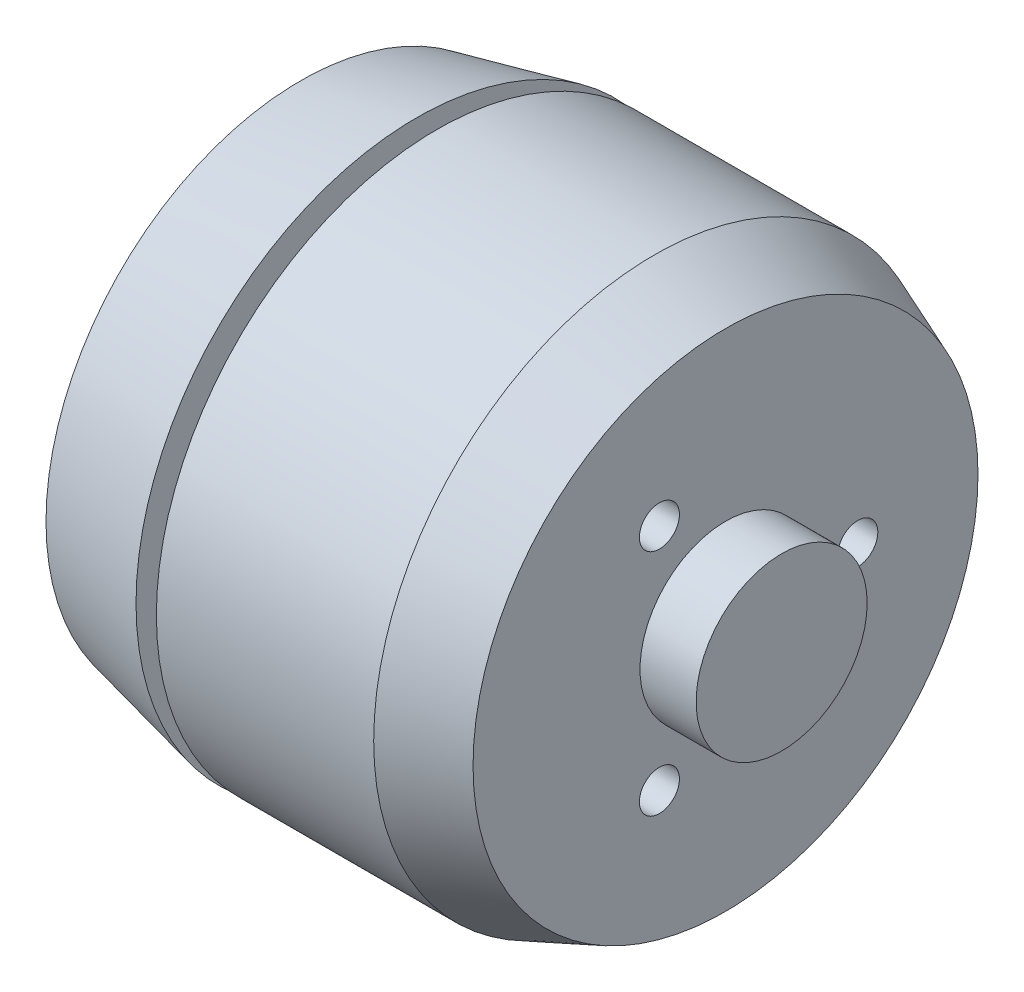
ISO-10303-21;
HEADER;
FILE_DESCRIPTION(('STEP AP214'),'2;1');
FILE_NAME('part.step','',(''),(''),'','','');
FILE_SCHEMA(('AUTOMOTIVE_DESIGN { 1 0 10303 214 1 1 1 1 }'));
ENDSEC;
DATA;
#1=APPLICATION_CONTEXT('core data for automotive mechanical design processes');
#2=APPLICATION_PROTOCOL_DEFINITION('international standard','automotive_design',2000,#1);
#3=PRODUCT_CONTEXT('',#1,'mechanical');
#4=PRODUCT('Part','Part','',(#3));
#5=PRODUCT_RELATED_PRODUCT_CATEGORY('part','',(#4));
#6=PRODUCT_DEFINITION_FORMATION('','',#4);
#7=PRODUCT_DEFINITION_CONTEXT('part definition',#1,'design');
#8=PRODUCT_DEFINITION('design','',#6,#7);
#9=PRODUCT_DEFINITION_SHAPE('','',#8);
#10=(LENGTH_UNIT() NAMED_UNIT(*) SI_UNIT(.MILLI.,.METRE.));
#11=(NAMED_UNIT(*) PLANE_ANGLE_UNIT() SI_UNIT($,.RADIAN.));
#12=(NAMED_UNIT(*) SI_UNIT($,.STERADIAN.) SOLID_ANGLE_UNIT());
#13=UNCERTAINTY_MEASURE_WITH_UNIT(LENGTH_MEASURE(1.E-05),#10,'distance_accuracy_value','');
#14=(GEOMETRIC_REPRESENTATION_CONTEXT(3) GLOBAL_UNCERTAINTY_ASSIGNED_CONTEXT((#13)) GLOBAL_UNIT_ASSIGNED_CONTEXT((#10,
#11,#12)) REPRESENTATION_CONTEXT('',''));
#15=CARTESIAN_POINT('',(0.,0.,0.));
#16=DIRECTION('',(0.,0.,1.));
#17=DIRECTION('',(1.,0.,0.));
#18=AXIS2_PLACEMENT_3D('',#15,#16,#17);
#19=CARTESIAN_POINT('',(6.,0.,0.));
#20=DIRECTION('',(0.,0.,-1.));
#21=DIRECTION('',(0.,-1.,0.));
#22=AXIS2_PLACEMENT_3D('',#19,#20,#21);
#23=PLANE('',#22);
#24=DIRECTION('',(0.,1.,0.));
#25=VECTOR('',#24,1.);
#26=CARTESIAN_POINT('',(12.9854,-5.08,0.));
#27=LINE('',#26,#25);
#28=CARTESIAN_POINT('',(12.9854,-5.08,0.));
#29=VERTEX_POINT('',#28);
#30=CARTESIAN_POINT('',(12.9854,5.08,0.));
#31=VERTEX_POINT('',#30);
#32=EDGE_CURVE('E130',#29,#31,#27,.T.);
#33=ORIENTED_EDGE('',*,*,#32,.F.);
#34=DIRECTION('',(1.,0.,0.));
#35=VECTOR('',#34,1.);
#36=CARTESIAN_POINT('',(8.2356,-5.08,0.));
#37=LINE('',#36,#35);
#38=CARTESIAN_POINT('',(8.2356,-5.08,0.));
#39=VERTEX_POINT('',#38);
#40=EDGE_CURVE('E135',#39,#29,#37,.T.);
#41=ORIENTED_EDGE('',*,*,#40,.F.);
#42=DIRECTION('',(0.,-1.,0.));
#43=VECTOR('',#42,1.);
#44=CARTESIAN_POINT('',(8.2356,-5.08,0.));
#45=LINE('',#44,#43);
#46=CARTESIAN_POINT('',(8.2356,5.08,0.));
#47=VERTEX_POINT('',#46);
#48=EDGE_CURVE('E10',#47,#39,#45,.T.);
#49=ORIENTED_EDGE('',*,*,#48,.F.);
#50=DIRECTION('',(-1.,0.,0.));
#51=VECTOR('',#50,1.);
#52=CARTESIAN_POINT('',(8.2356,5.08,0.));
#53=LINE('',#52,#51);
#54=EDGE_CURVE('E127',#31,#47,#53,.T.);
#55=ORIENTED_EDGE('',*,*,#54,.F.);
#56=EDGE_LOOP('',(#33,#41,#49,#55));
#57=FACE_BOUND('',#56,.T.);
#58=ADVANCED_FACE('F16',(#57),#23,.T.);
#59=CARTESIAN_POINT('',(8.2356,-5.08,-17.5));
#60=DIRECTION('',(-1.,0.,0.));
#61=DIRECTION('',(0.,0.,1.));
#62=AXIS2_PLACEMENT_3D('',#59,#60,#61);
#63=PLANE('',#62);
#64=CARTESIAN_POINT('',(8.2356,0.,-11.0612));
#65=DIRECTION('',(1.,0.,0.));
#66=DIRECTION('',(0.,0.,1.));
#67=AXIS2_PLACEMENT_3D('',#64,#65,#66);
#68=CIRCLE('',#67,4.);
#69=CARTESIAN_POINT('',(8.2356,0.,-15.0612));
#70=VERTEX_POINT('',#69);
#71=EDGE_CURVE('E257',#70,#70,#68,.T.);
#72=ORIENTED_EDGE('',*,*,#71,.F.);
#73=EDGE_LOOP('',(#72));
#74=FACE_BOUND('',#73,.T.);
#75=DIRECTION('',(0.,0.,1.));
#76=VECTOR('',#75,1.);
#77=CARTESIAN_POINT('',(8.2356,5.08,-17.5));
#78=LINE('',#77,#76);
#79=CARTESIAN_POINT('',(8.2356,5.08,-15.3348552618978));
#80=VERTEX_POINT('',#79);
#81=EDGE_CURVE('E27',#80,#47,#78,.T.);
#82=ORIENTED_EDGE('',*,*,#81,.T.);
#83=ORIENTED_EDGE('',*,*,#48,.T.);
#84=DIRECTION('',(0.,0.,1.));
#85=VECTOR('',#84,1.);
#86=CARTESIAN_POINT('',(8.2356,-5.08,-17.5));
#87=LINE('',#86,#85);
#88=CARTESIAN_POINT('',(8.2356,-5.08,-15.3348552618978));
#89=VERTEX_POINT('',#88);
#90=EDGE_CURVE('E147',#89,#39,#87,.T.);
#91=ORIENTED_EDGE('',*,*,#90,.F.);
#92=CARTESIAN_POINT('',(8.2356,0.,0.));
#93=DIRECTION('',(-1.,0.,0.));
#94=DIRECTION('',(0.,0.,1.));
#95=AXIS2_PLACEMENT_3D('',#92,#93,#94);
#96=CIRCLE('',#95,16.1543859649123);
#97=EDGE_CURVE('E333',#80,#89,#96,.T.);
#98=ORIENTED_EDGE('',*,*,#97,.F.);
#99=EDGE_LOOP('',(#82,#83,#91,#98));
#100=FACE_BOUND('',#99,.T.);
#101=ADVANCED_FACE('F438',(#74,#100),#63,.F.);
#102=CARTESIAN_POINT('',(8.2356,5.08,-17.5));
#103=DIRECTION('',(0.,1.,0.));
#104=DIRECTION('',(1.,0.,0.));
#105=AXIS2_PLACEMENT_3D('',#102,#103,#104);
#106=PLANE('',#105);
#107=DIRECTION('',(0.,0.,1.));
#108=VECTOR('',#107,1.);
#109=CARTESIAN_POINT('',(12.9854,5.08,-17.5));
#110=LINE('',#109,#108);
#111=CARTESIAN_POINT('',(12.9854,5.08,-16.4542744521131));
#112=VERTEX_POINT('',#111);
#113=EDGE_CURVE('E139',#112,#31,#110,.T.);
#114=ORIENTED_EDGE('',*,*,#113,.T.);
#115=ORIENTED_EDGE('',*,*,#54,.T.);
#116=ORIENTED_EDGE('',*,*,#81,.F.);
#117=CARTESIAN_POINT('',(12.9854,5.08,-16.4542744521131));
#118=CARTESIAN_POINT('',(11.4018708577131,5.08,-16.0822506345086));
#119=CARTESIAN_POINT('',(9.81858512751308,5.08,-15.7091919528578));
#120=CARTESIAN_POINT('',(8.2356,5.08,-15.3348552618978));
#121=(BOUNDED_CURVE() B_SPLINE_CURVE(3,(#117,#118,#119,#120),.UNSPECIFIED.,.F.,
.F.) B_SPLINE_CURVE_WITH_KNOTS((4,4),(0.0186183002080263,0.0234982279464003),
.UNSPECIFIED.) CURVE() GEOMETRIC_REPRESENTATION_ITEM() RATIONAL_B_SPLINE_CURVE((1.,1.,1.,1.)) REPRESENTATION_ITEM(''));
#122=EDGE_CURVE('E142',#112,#80,#121,.T.);
#123=ORIENTED_EDGE('',*,*,#122,.F.);
#124=EDGE_LOOP('',(#114,#115,#116,#123));
#125=FACE_BOUND('',#124,.T.);
#126=ADVANCED_FACE('F140',(#125),#106,.F.);
#127=CARTESIAN_POINT('',(8.2356,-5.08,-17.5));
#128=DIRECTION('',(0.,-1.,0.));
#129=DIRECTION('',(0.,0.,-1.));
#130=AXIS2_PLACEMENT_3D('',#127,#128,#129);
#131=PLANE('',#130);
#132=ORIENTED_EDGE('',*,*,#90,.T.);
#133=ORIENTED_EDGE('',*,*,#40,.T.);
#134=DIRECTION('',(0.,0.,1.));
#135=VECTOR('',#134,1.);
#136=CARTESIAN_POINT('',(12.9854,-5.08,-17.5));
#137=LINE('',#136,#135);
#138=CARTESIAN_POINT('',(12.9854,-5.08,-16.4542744521131));
#139=VERTEX_POINT('',#138);
#140=EDGE_CURVE('E151',#139,#29,#137,.T.);
#141=ORIENTED_EDGE('',*,*,#140,.F.);
#142=CARTESIAN_POINT('',(8.2356,-5.08,-15.3348552618978));
#143=CARTESIAN_POINT('',(9.81858357885326,-5.08,-15.7091915866381));
#144=CARTESIAN_POINT('',(11.4018724037992,-5.08,-16.0822509977358));
#145=CARTESIAN_POINT('',(12.9854,-5.08,-16.4542744521131));
#146=(BOUNDED_CURVE() B_SPLINE_CURVE(3,(#142,#143,#144,#145),.UNSPECIFIED.,.F.,
.F.) B_SPLINE_CURVE_WITH_KNOTS((4,4),(0.0186526350852368,0.0235325216490011),
.UNSPECIFIED.) CURVE() GEOMETRIC_REPRESENTATION_ITEM() RATIONAL_B_SPLINE_CURVE((1.,1.,1.,1.)) REPRESENTATION_ITEM(''));
#147=EDGE_CURVE('E183',#89,#139,#146,.T.);
#148=ORIENTED_EDGE('',*,*,#147,.F.);
#149=EDGE_LOOP('',(#132,#133,#141,#148));
#150=FACE_BOUND('',#149,.T.);
#151=ADVANCED_FACE('F480',(#150),#131,.F.);
#152=CARTESIAN_POINT('',(12.9854,-5.08,-17.5));
#153=DIRECTION('',(1.,0.,0.));
#154=DIRECTION('',(0.,0.,1.));
#155=AXIS2_PLACEMENT_3D('',#152,#153,#154);
#156=PLANE('',#155);
#157=ORIENTED_EDGE('',*,*,#140,.T.);
#158=ORIENTED_EDGE('',*,*,#32,.T.);
#159=ORIENTED_EDGE('',*,*,#113,.F.);
#160=CARTESIAN_POINT('',(12.9854,0.,0.));
#161=DIRECTION('',(1.,0.,0.));
#162=DIRECTION('',(0.,0.,-1.));
#163=AXIS2_PLACEMENT_3D('',#160,#161,#162);
#164=CIRCLE('',#163,17.2206140350877);
#165=EDGE_CURVE('E180',#139,#112,#164,.T.);
#166=ORIENTED_EDGE('',*,*,#165,.F.);
#167=EDGE_LOOP('',(#157,#158,#159,#166));
#168=FACE_BOUND('',#167,.T.);
#169=ADVANCED_FACE('F149',(#168),#156,.F.);
#170=CARTESIAN_POINT('',(11.436,-11.0612,0.));
#171=DIRECTION('',(-1.,0.,0.));
#172=DIRECTION('',(0.,0.,1.));
#173=AXIS2_PLACEMENT_3D('',#170,#171,#172);
#174=PLANE('',#173);
#175=CARTESIAN_POINT('',(11.436,-11.0612,0.));
#176=DIRECTION('',(-1.,0.,0.));
#177=DIRECTION('',(0.,0.,1.));
#178=AXIS2_PLACEMENT_3D('',#175,#176,#177);
#179=CIRCLE('',#178,4.);
#180=CARTESIAN_POINT('',(11.436,-11.0612,-4.));
#181=VERTEX_POINT('',#180);
#182=EDGE_CURVE('E334',#181,#181,#179,.T.);
#183=ORIENTED_EDGE('',*,*,#182,.T.);
#184=EDGE_LOOP('',(#183));
#185=FACE_BOUND('',#184,.T.);
#186=ADVANCED_FACE('F582',(#185),#174,.T.);
#187=CARTESIAN_POINT('',(11.436,-6.71751442127222,-6.71751442127219));
#188=DIRECTION('',(-1.,0.,0.));
#189=DIRECTION('',(0.,0.,1.));
#190=AXIS2_PLACEMENT_3D('',#187,#188,#189);
#191=PLANE('',#190);
#192=CARTESIAN_POINT('',(11.436,-6.71751442127222,-6.71751442127219));
#193=DIRECTION('',(-1.,0.,0.));
#194=DIRECTION('',(0.,0.,1.));
#195=AXIS2_PLACEMENT_3D('',#192,#193,#194);
#196=CIRCLE('',#195,1.5);
#197=CARTESIAN_POINT('',(11.436,-6.71751442127222,-8.21751442127219));
#198=VERTEX_POINT('',#197);
#199=EDGE_CURVE('E190',#198,#198,#196,.T.);
#200=ORIENTED_EDGE('',*,*,#199,.T.);
#201=EDGE_LOOP('',(#200));
#202=FACE_BOUND('',#201,.T.);
#203=ADVANCED_FACE('F584',(#202),#191,.T.);
#204=CARTESIAN_POINT('',(11.436,8.83883476483182,-8.83883476483186));
#205=DIRECTION('',(-1.,0.,0.));
#206=DIRECTION('',(0.,0.,1.));
#207=AXIS2_PLACEMENT_3D('',#204,#205,#206);
#208=PLANE('',#207);
#209=CARTESIAN_POINT('',(11.436,8.83883476483182,-8.83883476483186));
#210=DIRECTION('',(-1.,0.,0.));
#211=DIRECTION('',(0.,0.,1.));
#212=AXIS2_PLACEMENT_3D('',#209,#210,#211);
#213=CIRCLE('',#212,1.5);
#214=CARTESIAN_POINT('',(11.436,8.83883476483182,-10.3388347648319));
#215=VERTEX_POINT('',#214);
#216=EDGE_CURVE('E360',#215,#215,#213,.T.);
#217=ORIENTED_EDGE('',*,*,#216,.T.);
#218=EDGE_LOOP('',(#217));
#219=FACE_BOUND('',#218,.T.);
#220=ADVANCED_FACE('F590',(#219),#208,.T.);
#221=CARTESIAN_POINT('',(11.436,-8.83883476483183,8.83883476483186));
#222=DIRECTION('',(-1.,0.,0.));
#223=DIRECTION('',(0.,0.,1.));
#224=AXIS2_PLACEMENT_3D('',#221,#222,#223);
#225=PLANE('',#224);
#226=CARTESIAN_POINT('',(11.436,-8.83883476483183,8.83883476483186));
#227=DIRECTION('',(-1.,0.,0.));
#228=DIRECTION('',(0.,0.,1.));
#229=AXIS2_PLACEMENT_3D('',#226,#227,#228);
#230=CIRCLE('',#229,1.5);
#231=CARTESIAN_POINT('',(11.436,-8.83883476483183,7.33883476483186));
#232=VERTEX_POINT('',#231);
#233=EDGE_CURVE('E206',#232,#232,#230,.T.);
#234=ORIENTED_EDGE('',*,*,#233,.T.);
#235=EDGE_LOOP('',(#234));
#236=FACE_BOUND('',#235,.T.);
#237=ADVANCED_FACE('F432',(#236),#225,.T.);
#238=CARTESIAN_POINT('',(11.436,11.0612,0.));
#239=DIRECTION('',(-1.,0.,0.));
#240=DIRECTION('',(0.,0.,1.));
#241=AXIS2_PLACEMENT_3D('',#238,#239,#240);
#242=PLANE('',#241);
#243=CARTESIAN_POINT('',(11.436,11.0612,0.));
#244=DIRECTION('',(-1.,0.,0.));
#245=DIRECTION('',(0.,0.,1.));
#246=AXIS2_PLACEMENT_3D('',#243,#244,#245);
#247=CIRCLE('',#246,4.);
#248=CARTESIAN_POINT('',(11.436,11.0612,-4.));
#249=VERTEX_POINT('',#248);
#250=EDGE_CURVE('E377',#249,#249,#247,.T.);
#251=ORIENTED_EDGE('',*,*,#250,.T.);
#252=EDGE_LOOP('',(#251));
#253=FACE_BOUND('',#252,.T.);
#254=ADVANCED_FACE('F422',(#253),#242,.T.);
#255=CARTESIAN_POINT('',(11.436,0.,11.0612));
#256=DIRECTION('',(-1.,0.,0.));
#257=DIRECTION('',(0.,0.,1.));
#258=AXIS2_PLACEMENT_3D('',#255,#256,#257);
#259=PLANE('',#258);
#260=CARTESIAN_POINT('',(11.436,0.,11.0612));
#261=DIRECTION('',(-1.,0.,0.));
#262=DIRECTION('',(0.,0.,1.));
#263=AXIS2_PLACEMENT_3D('',#260,#261,#262);
#264=CIRCLE('',#263,4.);
#265=CARTESIAN_POINT('',(11.436,0.,7.0612));
#266=VERTEX_POINT('',#265);
#267=EDGE_CURVE('E228',#266,#266,#264,.T.);
#268=ORIENTED_EDGE('',*,*,#267,.T.);
#269=EDGE_LOOP('',(#268));
#270=FACE_BOUND('',#269,.T.);
#271=ADVANCED_FACE('F419',(#270),#259,.T.);
#272=CARTESIAN_POINT('',(11.436,6.71751442127222,6.71751442127219));
#273=DIRECTION('',(-1.,0.,0.));
#274=DIRECTION('',(0.,0.,1.));
#275=AXIS2_PLACEMENT_3D('',#272,#273,#274);
#276=PLANE('',#275);
#277=CARTESIAN_POINT('',(11.436,6.71751442127222,6.71751442127219));
#278=DIRECTION('',(-1.,0.,0.));
#279=DIRECTION('',(0.,0.,1.));
#280=AXIS2_PLACEMENT_3D('',#277,#278,#279);
#281=CIRCLE('',#280,1.5);
#282=CARTESIAN_POINT('',(11.436,6.71751442127222,5.21751442127219));
#283=VERTEX_POINT('',#282);
#284=EDGE_CURVE('E241',#283,#283,#281,.T.);
#285=ORIENTED_EDGE('',*,*,#284,.T.);
#286=EDGE_LOOP('',(#285));
#287=FACE_BOUND('',#286,.T.);
#288=ADVANCED_FACE('F421',(#287),#276,.T.);
#289=CARTESIAN_POINT('',(14.23,0.,-12.5));
#290=DIRECTION('',(-1.,0.,0.));
#291=DIRECTION('',(0.,0.,1.));
#292=AXIS2_PLACEMENT_3D('',#289,#290,#291);
#293=PLANE('',#292);
#294=CARTESIAN_POINT('',(14.23,0.,0.));
#295=DIRECTION('',(-1.,0.,0.));
#296=DIRECTION('',(0.,0.,1.));
#297=AXIS2_PLACEMENT_3D('',#294,#295,#296);
#298=CIRCLE('',#297,12.5);
#299=CARTESIAN_POINT('',(14.23,0.,-12.5));
#300=VERTEX_POINT('',#299);
#301=EDGE_CURVE('E164',#300,#300,#298,.T.);
#302=ORIENTED_EDGE('',*,*,#301,.T.);
#303=EDGE_LOOP('',(#302));
#304=FACE_BOUND('',#303,.T.);
#305=CARTESIAN_POINT('',(14.23,0.,0.));
#306=DIRECTION('',(-1.,0.,0.));
#307=DIRECTION('',(0.,0.,1.));
#308=AXIS2_PLACEMENT_3D('',#305,#306,#307);
#309=CIRCLE('',#308,17.5);
#310=CARTESIAN_POINT('',(14.23,0.,17.5));
#311=VERTEX_POINT('',#310);
#312=EDGE_CURVE('E170',#311,#311,#309,.T.);
#313=ORIENTED_EDGE('',*,*,#312,.F.);
#314=EDGE_LOOP('',(#313));
#315=FACE_BOUND('',#314,.T.);
#316=ADVANCED_FACE('F429',(#304,#315),#293,.F.);
#317=CARTESIAN_POINT('',(6.991,0.,-15.875));
#318=DIRECTION('',(1.,0.,0.));
#319=DIRECTION('',(0.,0.,1.));
#320=AXIS2_PLACEMENT_3D('',#317,#318,#319);
#321=PLANE('',#320);
#322=CARTESIAN_POINT('',(6.991,0.,0.));
#323=DIRECTION('',(-1.,0.,0.));
#324=DIRECTION('',(0.,0.,1.));
#325=AXIS2_PLACEMENT_3D('',#322,#323,#324);
#326=CIRCLE('',#325,2.5);
#327=CARTESIAN_POINT('',(6.991,0.,-2.5));
#328=VERTEX_POINT('',#327);
#329=EDGE_CURVE('E158',#328,#328,#326,.T.);
#330=ORIENTED_EDGE('',*,*,#329,.F.);
#331=EDGE_LOOP('',(#330));
#332=FACE_BOUND('',#331,.T.);
#333=CARTESIAN_POINT('',(6.991,6.71751442127222,6.71751442127219));
#334=DIRECTION('',(-1.,0.,0.));
#335=DIRECTION('',(0.,0.,1.));
#336=AXIS2_PLACEMENT_3D('',#333,#334,#335);
#337=CIRCLE('',#336,1.5);
#338=CARTESIAN_POINT('',(6.991,6.71751442127222,5.21751442127219));
#339=VERTEX_POINT('',#338);
#340=EDGE_CURVE('E168',#339,#339,#337,.T.);
#341=ORIENTED_EDGE('',*,*,#340,.F.);
#342=EDGE_LOOP('',(#341));
#343=FACE_BOUND('',#342,.T.);
#344=CARTESIAN_POINT('',(6.991,0.,11.0612));
#345=DIRECTION('',(-1.,0.,0.));
#346=DIRECTION('',(0.,0.,1.));
#347=AXIS2_PLACEMENT_3D('',#344,#345,#346);
#348=CIRCLE('',#347,4.);
#349=CARTESIAN_POINT('',(6.991,0.,7.0612));
#350=VERTEX_POINT('',#349);
#351=EDGE_CURVE('E246',#350,#350,#348,.T.);
#352=ORIENTED_EDGE('',*,*,#351,.F.);
#353=EDGE_LOOP('',(#352));
#354=FACE_BOUND('',#353,.T.);
#355=CARTESIAN_POINT('',(6.991,11.0612,0.));
#356=DIRECTION('',(-1.,0.,0.));
#357=DIRECTION('',(0.,0.,1.));
#358=AXIS2_PLACEMENT_3D('',#355,#356,#357);
#359=CIRCLE('',#358,4.);
#360=CARTESIAN_POINT('',(6.991,11.0612,-4.));
#361=VERTEX_POINT('',#360);
#362=EDGE_CURVE('E224',#361,#361,#359,.T.);
#363=ORIENTED_EDGE('',*,*,#362,.F.);
#364=EDGE_LOOP('',(#363));
#365=FACE_BOUND('',#364,.T.);
#366=CARTESIAN_POINT('',(6.991,0.,-11.0612));
#367=DIRECTION('',(-1.,0.,0.));
#368=DIRECTION('',(0.,0.,1.));
#369=AXIS2_PLACEMENT_3D('',#366,#367,#368);
#370=CIRCLE('',#369,4.);
#371=CARTESIAN_POINT('',(6.991,0.,-15.0612));
#372=VERTEX_POINT('',#371);
#373=EDGE_CURVE('E269',#372,#372,#370,.T.);
#374=ORIENTED_EDGE('',*,*,#373,.F.);
#375=EDGE_LOOP('',(#374));
#376=FACE_BOUND('',#375,.T.);
#377=CARTESIAN_POINT('',(6.991,-8.83883476483183,8.83883476483186));
#378=DIRECTION('',(-1.,0.,0.));
#379=DIRECTION('',(0.,0.,1.));
#380=AXIS2_PLACEMENT_3D('',#377,#378,#379);
#381=CIRCLE('',#380,1.5);
#382=CARTESIAN_POINT('',(6.991,-8.83883476483183,7.33883476483186));
#383=VERTEX_POINT('',#382);
#384=EDGE_CURVE('E205',#383,#383,#381,.T.);
#385=ORIENTED_EDGE('',*,*,#384,.F.);
#386=EDGE_LOOP('',(#385));
#387=FACE_BOUND('',#386,.T.);
#388=CARTESIAN_POINT('',(6.991,8.83883476483182,-8.83883476483186));
#389=DIRECTION('',(-1.,0.,0.));
#390=DIRECTION('',(0.,0.,1.));
#391=AXIS2_PLACEMENT_3D('',#388,#389,#390);
#392=CIRCLE('',#391,1.5);
#393=CARTESIAN_POINT('',(6.991,8.83883476483182,-10.3388347648319));
#394=VERTEX_POINT('',#393);
#395=EDGE_CURVE('E253',#394,#394,#392,.T.);
#396=ORIENTED_EDGE('',*,*,#395,.F.);
#397=EDGE_LOOP('',(#396));
#398=FACE_BOUND('',#397,.T.);
#399=CARTESIAN_POINT('',(6.991,-6.71751442127222,-6.71751442127219));
#400=DIRECTION('',(-1.,0.,0.));
#401=DIRECTION('',(0.,0.,1.));
#402=AXIS2_PLACEMENT_3D('',#399,#400,#401);
#403=CIRCLE('',#402,1.5);
#404=CARTESIAN_POINT('',(6.991,-6.71751442127222,-8.21751442127219));
#405=VERTEX_POINT('',#404);
#406=EDGE_CURVE('E364',#405,#405,#403,.T.);
#407=ORIENTED_EDGE('',*,*,#406,.F.);
#408=EDGE_LOOP('',(#407));
#409=FACE_BOUND('',#408,.T.);
#410=CARTESIAN_POINT('',(6.991,-11.0612,0.));
#411=DIRECTION('',(-1.,0.,0.));
#412=DIRECTION('',(0.,0.,1.));
#413=AXIS2_PLACEMENT_3D('',#410,#411,#412);
#414=CIRCLE('',#413,4.);
#415=CARTESIAN_POINT('',(6.991,-11.0612,-4.));
#416=VERTEX_POINT('',#415);
#417=EDGE_CURVE('E195',#416,#416,#414,.T.);
#418=ORIENTED_EDGE('',*,*,#417,.F.);
#419=EDGE_LOOP('',(#418));
#420=FACE_BOUND('',#419,.T.);
#421=CARTESIAN_POINT('',(6.991,0.,0.));
#422=DIRECTION('',(-1.,0.,0.));
#423=DIRECTION('',(0.,0.,1.));
#424=AXIS2_PLACEMENT_3D('',#421,#422,#423);
#425=CIRCLE('',#424,15.875);
#426=CARTESIAN_POINT('',(6.991,0.,15.875));
#427=VERTEX_POINT('',#426);
#428=EDGE_CURVE('E365',#427,#427,#425,.T.);
#429=ORIENTED_EDGE('',*,*,#428,.T.);
#430=EDGE_LOOP('',(#429));
#431=FACE_BOUND('',#430,.T.);
#432=ADVANCED_FACE('F475',(#332,#343,#354,#365,#376,#387,#398,#409,#420,#431),#321,.F.);
#433=CARTESIAN_POINT('',(6.,0.,-2.5));
#434=DIRECTION('',(1.,0.,0.));
#435=DIRECTION('',(0.,0.,1.));
#436=AXIS2_PLACEMENT_3D('',#433,#434,#435);
#437=PLANE('',#436);
#438=CARTESIAN_POINT('',(6.,0.,0.));
#439=DIRECTION('',(-1.,0.,0.));
#440=DIRECTION('',(0.,0.,1.));
#441=AXIS2_PLACEMENT_3D('',#438,#439,#440);
#442=CIRCLE('',#441,2.5);
#443=CARTESIAN_POINT('',(6.,0.,-2.5));
#444=VERTEX_POINT('',#443);
#445=EDGE_CURVE('E219',#444,#444,#442,.T.);
#446=ORIENTED_EDGE('',*,*,#445,.T.);
#447=EDGE_LOOP('',(#446));
#448=FACE_BOUND('',#447,.T.);
#449=ADVANCED_FACE('F478',(#448),#437,.F.);
#450=CARTESIAN_POINT('',(-281.397520162874,0.,0.));
#451=DIRECTION('',(-1.,0.,0.));
#452=DIRECTION('',(0.,0.,1.));
#453=AXIS2_PLACEMENT_3D('',#450,#451,#452);
#454=CYLINDRICAL_SURFACE('',#453,2.5);
#455=ORIENTED_EDGE('',*,*,#445,.F.);
#456=DIRECTION('',(1.,0.,0.));
#457=VECTOR('',#456,1.);
#458=CARTESIAN_POINT('',(-281.397520162874,0.,-2.50000000000005));
#459=LINE('',#458,#457);
#460=EDGE_CURVE('E223',#444,#328,#459,.T.);
#461=ORIENTED_EDGE('',*,*,#460,.T.);
#462=ORIENTED_EDGE('',*,*,#329,.T.);
#463=ORIENTED_EDGE('',*,*,#460,.F.);
#464=EDGE_LOOP('',(#455,#461,#462,#463));
#465=FACE_BOUND('',#464,.T.);
#466=ADVANCED_FACE('F451',(#465),#454,.T.);
#467=CARTESIAN_POINT('',(14.23,0.,0.));
#468=DIRECTION('',(1.,0.,0.));
#469=DIRECTION('',(0.,0.,-1.));
#470=AXIS2_PLACEMENT_3D('',#467,#468,#469);
#471=CONICAL_SURFACE('',#470,17.5,0.220818033952911);
#472=ORIENTED_EDGE('',*,*,#97,.T.);
#473=ORIENTED_EDGE('',*,*,#147,.T.);
#474=ORIENTED_EDGE('',*,*,#165,.T.);
#475=ORIENTED_EDGE('',*,*,#122,.T.);
#476=EDGE_LOOP('',(#472,#473,#474,#475));
#477=FACE_BOUND('',#476,.T.);
#478=ORIENTED_EDGE('',*,*,#312,.T.);
#479=DIRECTION('',(-0.975718603584016,0.,-0.219027867222549));
#480=VECTOR('',#479,1.);
#481=CARTESIAN_POINT('',(14.23,0.,17.5));
#482=LINE('',#481,#480);
#483=EDGE_CURVE('E174',#311,#427,#482,.T.);
#484=ORIENTED_EDGE('',*,*,#483,.T.);
#485=ORIENTED_EDGE('',*,*,#428,.F.);
#486=ORIENTED_EDGE('',*,*,#483,.F.);
#487=EDGE_LOOP('',(#478,#484,#485,#486));
#488=FACE_BOUND('',#487,.T.);
#489=ADVANCED_FACE('F448',(#477,#488),#471,.T.);
#490=CARTESIAN_POINT('',(-281.397520162874,0.,0.));
#491=DIRECTION('',(-1.,0.,0.));
#492=DIRECTION('',(0.,0.,1.));
#493=AXIS2_PLACEMENT_3D('',#490,#491,#492);
#494=CYLINDRICAL_SURFACE('',#493,12.5);
#495=ORIENTED_EDGE('',*,*,#301,.F.);
#496=DIRECTION('',(1.,0.,0.));
#497=VECTOR('',#496,1.);
#498=CARTESIAN_POINT('',(-281.397520162874,0.,-12.5));
#499=LINE('',#498,#497);
#500=CARTESIAN_POINT('',(15.5,0.,-12.5));
#501=VERTEX_POINT('',#500);
#502=EDGE_CURVE('E167',#300,#501,#499,.T.);
#503=ORIENTED_EDGE('',*,*,#502,.T.);
#504=CARTESIAN_POINT('',(15.5,0.,0.));
#505=DIRECTION('',(-1.,0.,0.));
#506=DIRECTION('',(0.,0.,1.));
#507=AXIS2_PLACEMENT_3D('',#504,#505,#506);
#508=CIRCLE('',#507,12.5);
#509=EDGE_CURVE('E200',#501,#501,#508,.T.);
#510=ORIENTED_EDGE('',*,*,#509,.T.);
#511=ORIENTED_EDGE('',*,*,#502,.F.);
#512=EDGE_LOOP('',(#495,#503,#510,#511));
#513=FACE_BOUND('',#512,.T.);
#514=ADVANCED_FACE('F450',(#513),#494,.T.);
#515=CARTESIAN_POINT('',(11.436,6.71751442127222,6.71751442127219));
#516=DIRECTION('',(-1.,0.,0.));
#517=DIRECTION('',(0.,0.,1.));
#518=AXIS2_PLACEMENT_3D('',#515,#516,#517);
#519=CYLINDRICAL_SURFACE('',#518,1.5);
#520=ORIENTED_EDGE('',*,*,#284,.F.);
#521=DIRECTION('',(-1.,0.,0.));
#522=VECTOR('',#521,1.);
#523=CARTESIAN_POINT('',(11.436,6.71751442127222,5.21751442127219));
#524=LINE('',#523,#522);
#525=EDGE_CURVE('E245',#283,#339,#524,.T.);
#526=ORIENTED_EDGE('',*,*,#525,.T.);
#527=ORIENTED_EDGE('',*,*,#340,.T.);
#528=ORIENTED_EDGE('',*,*,#525,.F.);
#529=EDGE_LOOP('',(#520,#526,#527,#528));
#530=FACE_BOUND('',#529,.T.);
#531=ADVANCED_FACE('F504',(#530),#519,.F.);
#532=CARTESIAN_POINT('',(11.436,0.,11.0612));
#533=DIRECTION('',(-1.,0.,0.));
#534=DIRECTION('',(0.,0.,1.));
#535=AXIS2_PLACEMENT_3D('',#532,#533,#534);
#536=CYLINDRICAL_SURFACE('',#535,4.);
#537=ORIENTED_EDGE('',*,*,#267,.F.);
#538=DIRECTION('',(-1.,0.,0.));
#539=VECTOR('',#538,1.);
#540=CARTESIAN_POINT('',(11.436,0.,7.0612));
#541=LINE('',#540,#539);
#542=EDGE_CURVE('E237',#266,#350,#541,.T.);
#543=ORIENTED_EDGE('',*,*,#542,.T.);
#544=ORIENTED_EDGE('',*,*,#351,.T.);
#545=ORIENTED_EDGE('',*,*,#542,.F.);
#546=EDGE_LOOP('',(#537,#543,#544,#545));
#547=FACE_BOUND('',#546,.T.);
#548=ADVANCED_FACE('F416',(#547),#536,.F.);
#549=CARTESIAN_POINT('',(11.436,11.0612,0.));
#550=DIRECTION('',(-1.,0.,0.));
#551=DIRECTION('',(0.,0.,1.));
#552=AXIS2_PLACEMENT_3D('',#549,#550,#551);
#553=CYLINDRICAL_SURFACE('',#552,4.);
#554=ORIENTED_EDGE('',*,*,#250,.F.);
#555=DIRECTION('',(-1.,0.,0.));
#556=VECTOR('',#555,1.);
#557=CARTESIAN_POINT('',(11.436,11.0612,-4.));
#558=LINE('',#557,#556);
#559=EDGE_CURVE('E229',#249,#361,#558,.T.);
#560=ORIENTED_EDGE('',*,*,#559,.T.);
#561=ORIENTED_EDGE('',*,*,#362,.T.);
#562=ORIENTED_EDGE('',*,*,#559,.F.);
#563=EDGE_LOOP('',(#554,#560,#561,#562));
#564=FACE_BOUND('',#563,.T.);
#565=ADVANCED_FACE('F495',(#564),#553,.F.);
#566=CARTESIAN_POINT('',(11.436,0.,-11.0612));
#567=DIRECTION('',(-1.,0.,0.));
#568=DIRECTION('',(0.,0.,1.));
#569=AXIS2_PLACEMENT_3D('',#566,#567,#568);
#570=CYLINDRICAL_SURFACE('',#569,4.);
#571=ORIENTED_EDGE('',*,*,#71,.T.);
#572=DIRECTION('',(-1.,0.,0.));
#573=VECTOR('',#572,1.);
#574=CARTESIAN_POINT('',(11.436,0.,-15.0612));
#575=LINE('',#574,#573);
#576=EDGE_CURVE('E261',#70,#372,#575,.T.);
#577=ORIENTED_EDGE('',*,*,#576,.T.);
#578=ORIENTED_EDGE('',*,*,#373,.T.);
#579=ORIENTED_EDGE('',*,*,#576,.F.);
#580=EDGE_LOOP('',(#571,#577,#578,#579));
#581=FACE_BOUND('',#580,.T.);
#582=ADVANCED_FACE('F491',(#581),#570,.F.);
#583=CARTESIAN_POINT('',(11.436,-8.83883476483183,8.83883476483186));
#584=DIRECTION('',(-1.,0.,0.));
#585=DIRECTION('',(0.,0.,1.));
#586=AXIS2_PLACEMENT_3D('',#583,#584,#585);
#587=CYLINDRICAL_SURFACE('',#586,1.5);
#588=ORIENTED_EDGE('',*,*,#233,.F.);
#589=DIRECTION('',(-1.,0.,0.));
#590=VECTOR('',#589,1.);
#591=CARTESIAN_POINT('',(11.436,-8.83883476483183,7.33883476483186));
#592=LINE('',#591,#590);
#593=EDGE_CURVE('E201',#232,#383,#592,.T.);
#594=ORIENTED_EDGE('',*,*,#593,.T.);
#595=ORIENTED_EDGE('',*,*,#384,.T.);
#596=ORIENTED_EDGE('',*,*,#593,.F.);
#597=EDGE_LOOP('',(#588,#594,#595,#596));
#598=FACE_BOUND('',#597,.T.);
#599=ADVANCED_FACE('F487',(#598),#587,.F.);
#600=CARTESIAN_POINT('',(11.436,8.83883476483182,-8.83883476483186));
#601=DIRECTION('',(-1.,0.,0.));
#602=DIRECTION('',(0.,0.,1.));
#603=AXIS2_PLACEMENT_3D('',#600,#601,#602);
#604=CYLINDRICAL_SURFACE('',#603,1.5);
#605=ORIENTED_EDGE('',*,*,#216,.F.);
#606=DIRECTION('',(-1.,0.,0.));
#607=VECTOR('',#606,1.);
#608=CARTESIAN_POINT('',(11.436,8.83883476483182,-10.3388347648319));
#609=LINE('',#608,#607);
#610=EDGE_CURVE('E256',#215,#394,#609,.T.);
#611=ORIENTED_EDGE('',*,*,#610,.T.);
#612=ORIENTED_EDGE('',*,*,#395,.T.);
#613=ORIENTED_EDGE('',*,*,#610,.F.);
#614=EDGE_LOOP('',(#605,#611,#612,#613));
#615=FACE_BOUND('',#614,.T.);
#616=ADVANCED_FACE('F490',(#615),#604,.F.);
#617=CARTESIAN_POINT('',(11.436,-6.71751442127222,-6.71751442127219));
#618=DIRECTION('',(-1.,0.,0.));
#619=DIRECTION('',(0.,0.,1.));
#620=AXIS2_PLACEMENT_3D('',#617,#618,#619);
#621=CYLINDRICAL_SURFACE('',#620,1.5);
#622=ORIENTED_EDGE('',*,*,#199,.F.);
#623=DIRECTION('',(-1.,0.,0.));
#624=VECTOR('',#623,1.);
#625=CARTESIAN_POINT('',(11.436,-6.71751442127222,-8.21751442127219));
#626=LINE('',#625,#624);
#627=EDGE_CURVE('E194',#198,#405,#626,.T.);
#628=ORIENTED_EDGE('',*,*,#627,.T.);
#629=ORIENTED_EDGE('',*,*,#406,.T.);
#630=ORIENTED_EDGE('',*,*,#627,.F.);
#631=EDGE_LOOP('',(#622,#628,#629,#630));
#632=FACE_BOUND('',#631,.T.);
#633=ADVANCED_FACE('F18',(#632),#621,.F.);
#634=CARTESIAN_POINT('',(11.436,-11.0612,0.));
#635=DIRECTION('',(-1.,0.,0.));
#636=DIRECTION('',(0.,0.,1.));
#637=AXIS2_PLACEMENT_3D('',#634,#635,#636);
#638=CYLINDRICAL_SURFACE('',#637,4.);
#639=ORIENTED_EDGE('',*,*,#182,.F.);
#640=DIRECTION('',(-1.,0.,0.));
#641=VECTOR('',#640,1.);
#642=CARTESIAN_POINT('',(11.436,-11.0612,-4.));
#643=LINE('',#642,#641);
#644=EDGE_CURVE('E341',#181,#416,#643,.T.);
#645=ORIENTED_EDGE('',*,*,#644,.T.);
#646=ORIENTED_EDGE('',*,*,#417,.T.);
#647=ORIENTED_EDGE('',*,*,#644,.F.);
#648=EDGE_LOOP('',(#639,#645,#646,#647));
#649=FACE_BOUND('',#648,.T.);
#650=ADVANCED_FACE('F468',(#649),#638,.F.);
#651=CARTESIAN_POINT('',(28.5,7.1428,4.12389750276767));
#652=DIRECTION('',(1.,0.,0.));
#653=DIRECTION('',(0.,0.,-1.));
#654=AXIS2_PLACEMENT_3D('',#651,#652,#653);
#655=CYLINDRICAL_SURFACE('',#654,1.25);
#656=CARTESIAN_POINT('',(28.5,7.1428,4.12389750276767));
#657=DIRECTION('',(1.,0.,0.));
#658=DIRECTION('',(0.,0.,-1.));
#659=AXIS2_PLACEMENT_3D('',#656,#657,#658);
#660=CIRCLE('',#659,1.25);
#661=CARTESIAN_POINT('',(28.5,7.1428,5.37389750276767));
#662=VERTEX_POINT('',#661);
#663=EDGE_CURVE('E279',#662,#662,#660,.T.);
#664=ORIENTED_EDGE('',*,*,#663,.F.);
#665=DIRECTION('',(1.,0.,0.));
#666=VECTOR('',#665,1.);
#667=CARTESIAN_POINT('',(28.5,7.1428,5.37389750276767));
#668=LINE('',#667,#666);
#669=CARTESIAN_POINT('',(33.5,7.1428,5.37389750276767));
#670=VERTEX_POINT('',#669);
#671=EDGE_CURVE('E20',#662,#670,#668,.T.);
#672=ORIENTED_EDGE('',*,*,#671,.T.);
#673=CARTESIAN_POINT('',(33.5,7.1428,4.12389750276767));
#674=DIRECTION('',(1.,0.,0.));
#675=DIRECTION('',(0.,0.,-1.));
#676=AXIS2_PLACEMENT_3D('',#673,#674,#675);
#677=CIRCLE('',#676,1.25);
#678=EDGE_CURVE('E207',#670,#670,#677,.T.);
#679=ORIENTED_EDGE('',*,*,#678,.T.);
#680=ORIENTED_EDGE('',*,*,#671,.F.);
#681=EDGE_LOOP('',(#664,#672,#679,#680));
#682=FACE_BOUND('',#681,.T.);
#683=ADVANCED_FACE('F466',(#682),#655,.F.);
#684=CARTESIAN_POINT('',(28.5,-7.1428,4.12389750276767));
#685=DIRECTION('',(1.,0.,0.));
#686=DIRECTION('',(0.,0.,-1.));
#687=AXIS2_PLACEMENT_3D('',#684,#685,#686);
#688=CYLINDRICAL_SURFACE('',#687,1.25);
#689=CARTESIAN_POINT('',(28.5,-7.1428,4.12389750276767));
#690=DIRECTION('',(1.,0.,0.));
#691=DIRECTION('',(0.,0.,-1.));
#692=AXIS2_PLACEMENT_3D('',#689,#690,#691);
#693=CIRCLE('',#692,1.25);
#694=CARTESIAN_POINT('',(28.5,-7.1428,5.37389750276767));
#695=VERTEX_POINT('',#694);
#696=EDGE_CURVE('E189',#695,#695,#693,.T.);
#697=ORIENTED_EDGE('',*,*,#696,.F.);
#698=DIRECTION('',(1.,0.,0.));
#699=VECTOR('',#698,1.);
#700=CARTESIAN_POINT('',(28.5,-7.1428,5.37389750276767));
#701=LINE('',#700,#699);
#702=CARTESIAN_POINT('',(33.5,-7.1428,5.37389750276767));
#703=VERTEX_POINT('',#702);
#704=EDGE_CURVE('E230',#695,#703,#701,.T.);
#705=ORIENTED_EDGE('',*,*,#704,.T.);
#706=CARTESIAN_POINT('',(33.5,-7.1428,4.12389750276767));
#707=DIRECTION('',(1.,0.,0.));
#708=DIRECTION('',(0.,0.,-1.));
#709=AXIS2_PLACEMENT_3D('',#706,#707,#708);
#710=CIRCLE('',#709,1.25);
#711=EDGE_CURVE('E211',#703,#703,#710,.T.);
#712=ORIENTED_EDGE('',*,*,#711,.T.);
#713=ORIENTED_EDGE('',*,*,#704,.F.);
#714=EDGE_LOOP('',(#697,#705,#712,#713));
#715=FACE_BOUND('',#714,.T.);
#716=ADVANCED_FACE('F296',(#715),#688,.F.);
#717=CARTESIAN_POINT('',(28.5,0.,-8.24779500553533));
#718=DIRECTION('',(1.,0.,0.));
#719=DIRECTION('',(0.,0.,-1.));
#720=AXIS2_PLACEMENT_3D('',#717,#718,#719);
#721=CYLINDRICAL_SURFACE('',#720,1.25);
#722=CARTESIAN_POINT('',(28.5,0.,-8.24779500553533));
#723=DIRECTION('',(1.,0.,0.));
#724=DIRECTION('',(0.,0.,-1.));
#725=AXIS2_PLACEMENT_3D('',#722,#723,#724);
#726=CIRCLE('',#725,1.25);
#727=CARTESIAN_POINT('',(28.5,0.,-6.99779500553533));
#728=VERTEX_POINT('',#727);
#729=EDGE_CURVE('E184',#728,#728,#726,.T.);
#730=ORIENTED_EDGE('',*,*,#729,.F.);
#731=DIRECTION('',(1.,0.,0.));
#732=VECTOR('',#731,1.);
#733=CARTESIAN_POINT('',(28.5,0.,-6.99779500553533));
#734=LINE('',#733,#732);
#735=CARTESIAN_POINT('',(33.5,0.,-6.99779500553533));
#736=VERTEX_POINT('',#735);
#737=EDGE_CURVE('E233',#728,#736,#734,.T.);
#738=ORIENTED_EDGE('',*,*,#737,.T.);
#739=CARTESIAN_POINT('',(33.5,0.,-8.24779500553533));
#740=DIRECTION('',(1.,0.,0.));
#741=DIRECTION('',(0.,0.,-1.));
#742=AXIS2_PLACEMENT_3D('',#739,#740,#741);
#743=CIRCLE('',#742,1.25);
#744=EDGE_CURVE('E162',#736,#736,#743,.T.);
#745=ORIENTED_EDGE('',*,*,#744,.T.);
#746=ORIENTED_EDGE('',*,*,#737,.F.);
#747=EDGE_LOOP('',(#730,#738,#745,#746));
#748=FACE_BOUND('',#747,.T.);
#749=ADVANCED_FACE('F462',(#748),#721,.F.);
#750=CARTESIAN_POINT('',(-287.397520162874,0.,0.));
#751=DIRECTION('',(-1.,0.,0.));
#752=DIRECTION('',(0.,0.,1.));
#753=AXIS2_PLACEMENT_3D('',#750,#751,#752);
#754=CYLINDRICAL_SURFACE('',#753,5.334);
#755=CARTESIAN_POINT('',(33.5,0.,0.));
#756=DIRECTION('',(-1.,0.,0.));
#757=DIRECTION('',(0.,0.,1.));
#758=AXIS2_PLACEMENT_3D('',#755,#756,#757);
#759=CIRCLE('',#758,5.334);
#760=CARTESIAN_POINT('',(33.5,0.,-5.334));
#761=VERTEX_POINT('',#760);
#762=EDGE_CURVE('E212',#761,#761,#759,.T.);
#763=ORIENTED_EDGE('',*,*,#762,.F.);
#764=DIRECTION('',(1.,0.,0.));
#765=VECTOR('',#764,1.);
#766=CARTESIAN_POINT('',(-287.397520162874,0.,-5.334));
#767=LINE('',#766,#765);
#768=CARTESIAN_POINT('',(37.,0.,-5.334));
#769=VERTEX_POINT('',#768);
#770=EDGE_CURVE('E178',#761,#769,#767,.T.);
#771=ORIENTED_EDGE('',*,*,#770,.T.);
#772=CARTESIAN_POINT('',(37.,0.,0.));
#773=DIRECTION('',(-1.,0.,0.));
#774=DIRECTION('',(0.,0.,1.));
#775=AXIS2_PLACEMENT_3D('',#772,#773,#774);
#776=CIRCLE('',#775,5.334);
#777=EDGE_CURVE('E188',#769,#769,#776,.T.);
#778=ORIENTED_EDGE('',*,*,#777,.T.);
#779=ORIENTED_EDGE('',*,*,#770,.F.);
#780=EDGE_LOOP('',(#763,#771,#778,#779));
#781=FACE_BOUND('',#780,.T.);
#782=ADVANCED_FACE('F457',(#781),#754,.T.);
#783=CARTESIAN_POINT('',(33.5,0.,0.));
#784=DIRECTION('',(-1.,0.,0.));
#785=DIRECTION('',(0.,0.,1.));
#786=AXIS2_PLACEMENT_3D('',#783,#784,#785);
#787=CONICAL_SURFACE('',#786,15.748,0.375453755800143);
#788=CARTESIAN_POINT('',(29.055,0.,0.));
#789=DIRECTION('',(-1.,0.,0.));
#790=DIRECTION('',(0.,0.,1.));
#791=AXIS2_PLACEMENT_3D('',#788,#789,#790);
#792=CIRCLE('',#791,17.5);
#793=CARTESIAN_POINT('',(29.055,0.,-17.5));
#794=VERTEX_POINT('',#793);
#795=EDGE_CURVE('E179',#794,#794,#792,.T.);
#796=ORIENTED_EDGE('',*,*,#795,.F.);
#797=DIRECTION('',(0.930341327840394,0.,0.366694714595361));
#798=VECTOR('',#797,1.);
#799=CARTESIAN_POINT('',(33.5,0.,-15.748));
#800=LINE('',#799,#798);
#801=CARTESIAN_POINT('',(33.5,0.,-15.748));
#802=VERTEX_POINT('',#801);
#803=EDGE_CURVE('E175',#794,#802,#800,.T.);
#804=ORIENTED_EDGE('',*,*,#803,.T.);
#805=CARTESIAN_POINT('',(33.5,0.,0.));
#806=DIRECTION('',(-1.,0.,0.));
#807=DIRECTION('',(0.,0.,1.));
#808=AXIS2_PLACEMENT_3D('',#805,#806,#807);
#809=CIRCLE('',#808,15.748);
#810=EDGE_CURVE('E216',#802,#802,#809,.T.);
#811=ORIENTED_EDGE('',*,*,#810,.T.);
#812=ORIENTED_EDGE('',*,*,#803,.F.);
#813=EDGE_LOOP('',(#796,#804,#811,#812));
#814=FACE_BOUND('',#813,.T.);
#815=ADVANCED_FACE('F314',(#814),#787,.T.);
#816=CARTESIAN_POINT('',(-287.397520162874,0.,0.));
#817=DIRECTION('',(-1.,0.,0.));
#818=DIRECTION('',(0.,0.,1.));
#819=AXIS2_PLACEMENT_3D('',#816,#817,#818);
#820=CYLINDRICAL_SURFACE('',#819,17.5);
#821=CARTESIAN_POINT('',(15.5,0.,0.));
#822=DIRECTION('',(-1.,0.,0.));
#823=DIRECTION('',(0.,0.,1.));
#824=AXIS2_PLACEMENT_3D('',#821,#822,#823);
#825=CIRCLE('',#824,17.5);
#826=CARTESIAN_POINT('',(15.5,0.,-17.5));
#827=VERTEX_POINT('',#826);
#828=EDGE_CURVE('E196',#827,#827,#825,.T.);
#829=ORIENTED_EDGE('',*,*,#828,.F.);
#830=DIRECTION('',(1.,0.,0.));
#831=VECTOR('',#830,1.);
#832=CARTESIAN_POINT('',(-287.397520162874,0.,-17.5));
#833=LINE('',#832,#831);
#834=EDGE_CURVE('E265',#827,#794,#833,.T.);
#835=ORIENTED_EDGE('',*,*,#834,.T.);
#836=ORIENTED_EDGE('',*,*,#795,.T.);
#837=ORIENTED_EDGE('',*,*,#834,.F.);
#838=EDGE_LOOP('',(#829,#835,#836,#837));
#839=FACE_BOUND('',#838,.T.);
#840=ADVANCED_FACE('F303',(#839),#820,.T.);
#841=CARTESIAN_POINT('',(33.5,0.,-15.748));
#842=DIRECTION('',(-1.,0.,0.));
#843=DIRECTION('',(0.,0.,1.));
#844=AXIS2_PLACEMENT_3D('',#841,#842,#843);
#845=PLANE('',#844);
#846=ORIENTED_EDGE('',*,*,#744,.F.);
#847=EDGE_LOOP('',(#846));
#848=FACE_BOUND('',#847,.T.);
#849=ORIENTED_EDGE('',*,*,#711,.F.);
#850=EDGE_LOOP('',(#849));
#851=FACE_BOUND('',#850,.T.);
#852=ORIENTED_EDGE('',*,*,#678,.F.);
#853=EDGE_LOOP('',(#852));
#854=FACE_BOUND('',#853,.T.);
#855=ORIENTED_EDGE('',*,*,#762,.T.);
#856=EDGE_LOOP('',(#855));
#857=FACE_BOUND('',#856,.T.);
#858=ORIENTED_EDGE('',*,*,#810,.F.);
#859=EDGE_LOOP('',(#858));
#860=FACE_BOUND('',#859,.T.);
#861=ADVANCED_FACE('F299',(#848,#851,#854,#857,#860),#845,.F.);
#862=CARTESIAN_POINT('',(37.,0.,-5.334));
#863=DIRECTION('',(-1.,0.,0.));
#864=DIRECTION('',(0.,0.,1.));
#865=AXIS2_PLACEMENT_3D('',#862,#863,#864);
#866=PLANE('',#865);
#867=ORIENTED_EDGE('',*,*,#777,.F.);
#868=EDGE_LOOP('',(#867));
#869=FACE_BOUND('',#868,.T.);
#870=ADVANCED_FACE('F302',(#869),#866,.F.);
#871=CARTESIAN_POINT('',(28.5,0.,-8.24779500553533));
#872=DIRECTION('',(1.,0.,0.));
#873=DIRECTION('',(0.,1.,0.));
#874=AXIS2_PLACEMENT_3D('',#871,#872,#873);
#875=PLANE('',#874);
#876=ORIENTED_EDGE('',*,*,#729,.T.);
#877=EDGE_LOOP('',(#876));
#878=FACE_BOUND('',#877,.T.);
#879=ADVANCED_FACE('F474',(#878),#875,.T.);
#880=CARTESIAN_POINT('',(28.5,-7.1428,4.12389750276767));
#881=DIRECTION('',(1.,0.,0.));
#882=DIRECTION('',(0.,1.,0.));
#883=AXIS2_PLACEMENT_3D('',#880,#881,#882);
#884=PLANE('',#883);
#885=ORIENTED_EDGE('',*,*,#696,.T.);
#886=EDGE_LOOP('',(#885));
#887=FACE_BOUND('',#886,.T.);
#888=ADVANCED_FACE('F291',(#887),#884,.T.);
#889=CARTESIAN_POINT('',(28.5,7.1428,4.12389750276767));
#890=DIRECTION('',(1.,0.,0.));
#891=DIRECTION('',(0.,1.,0.));
#892=AXIS2_PLACEMENT_3D('',#889,#890,#891);
#893=PLANE('',#892);
#894=ORIENTED_EDGE('',*,*,#663,.T.);
#895=EDGE_LOOP('',(#894));
#896=FACE_BOUND('',#895,.T.);
#897=ADVANCED_FACE('F473',(#896),#893,.T.);
#898=CARTESIAN_POINT('',(15.5,0.,-17.5));
#899=DIRECTION('',(1.,0.,0.));
#900=DIRECTION('',(0.,1.,0.));
#901=AXIS2_PLACEMENT_3D('',#898,#899,#900);
#902=PLANE('',#901);
#903=ORIENTED_EDGE('',*,*,#509,.F.);
#904=EDGE_LOOP('',(#903));
#905=FACE_BOUND('',#904,.T.);
#906=ORIENTED_EDGE('',*,*,#828,.T.);
#907=EDGE_LOOP('',(#906));
#908=FACE_BOUND('',#907,.T.);
#909=ADVANCED_FACE('F615',(#905,#908),#902,.F.);
#910=CLOSED_SHELL('',(#58,#101,#126,#151,#169,#186,#203,#220,#237,#254,#271,#288,#316,#432,#449,
#466,#489,#514,#531,#548,#565,#582,#599,#616,#633,#650,#683,#716,#749,#782,#815,#840,#861,#870,
#879,#888,#897,#909));
#911=MANIFOLD_SOLID_BREP('B1',#910);
#912=ADVANCED_BREP_SHAPE_REPRESENTATION('',(#18,#911),#14);
#913=SHAPE_DEFINITION_REPRESENTATION(#9,#912);
ENDSEC;
END-ISO-10303-21;
